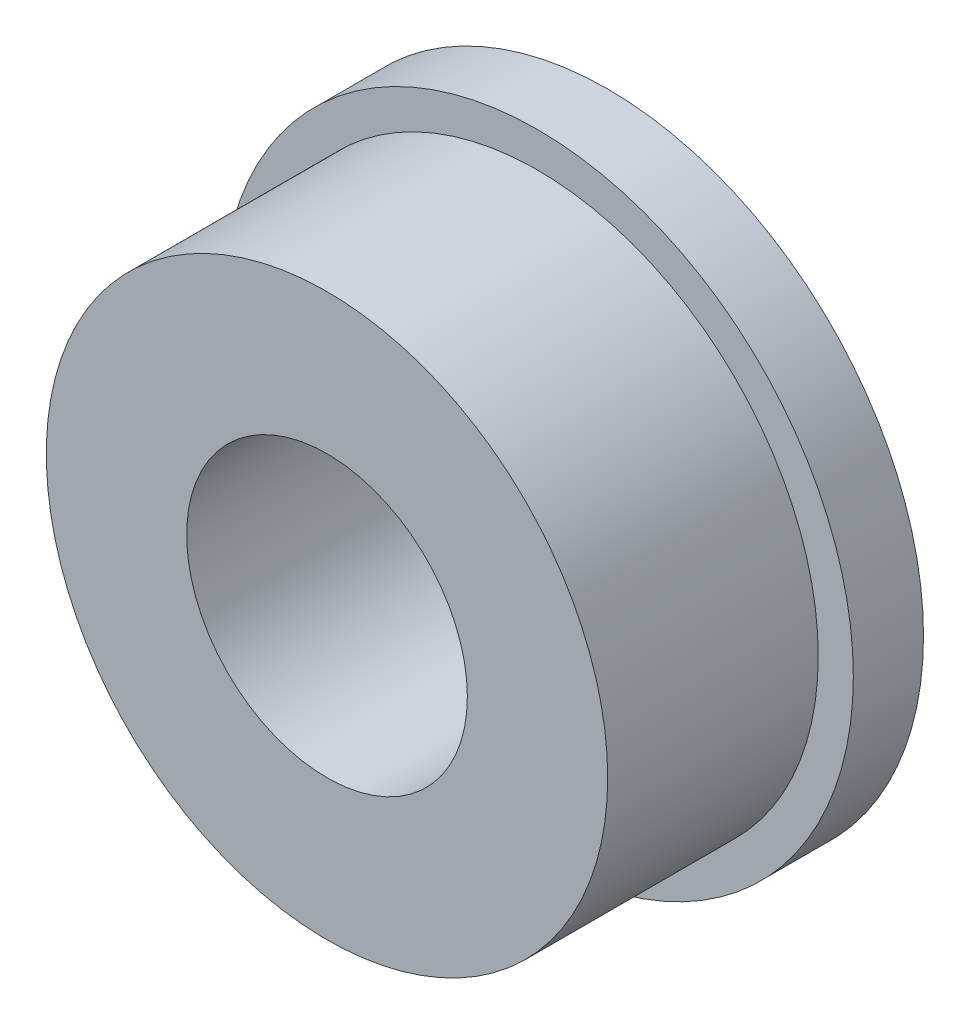
ISO-10303-21;
HEADER;
FILE_DESCRIPTION(('STEP AP214'),'2;1');
FILE_NAME('part.step','',(''),(''),'','','');
FILE_SCHEMA(('AUTOMOTIVE_DESIGN { 1 0 10303 214 1 1 1 1 }'));
ENDSEC;
DATA;
#1=APPLICATION_CONTEXT('core data for automotive mechanical design processes');
#2=APPLICATION_PROTOCOL_DEFINITION('international standard','automotive_design',2000,#1);
#3=PRODUCT_CONTEXT('',#1,'mechanical');
#4=PRODUCT('Part','Part','',(#3));
#5=PRODUCT_RELATED_PRODUCT_CATEGORY('part','',(#4));
#6=PRODUCT_DEFINITION_FORMATION('','',#4);
#7=PRODUCT_DEFINITION_CONTEXT('part definition',#1,'design');
#8=PRODUCT_DEFINITION('design','',#6,#7);
#9=PRODUCT_DEFINITION_SHAPE('','',#8);
#10=(LENGTH_UNIT() NAMED_UNIT(*) SI_UNIT(.MILLI.,.METRE.));
#11=(NAMED_UNIT(*) PLANE_ANGLE_UNIT() SI_UNIT($,.RADIAN.));
#12=(NAMED_UNIT(*) SI_UNIT($,.STERADIAN.) SOLID_ANGLE_UNIT());
#13=UNCERTAINTY_MEASURE_WITH_UNIT(LENGTH_MEASURE(1.E-05),#10,'distance_accuracy_value','');
#14=(GEOMETRIC_REPRESENTATION_CONTEXT(3) GLOBAL_UNCERTAINTY_ASSIGNED_CONTEXT((#13)) GLOBAL_UNIT_ASSIGNED_CONTEXT((#10,
#11,#12)) REPRESENTATION_CONTEXT('',''));
#15=CARTESIAN_POINT('',(0.,0.,0.));
#16=DIRECTION('',(0.,0.,1.));
#17=DIRECTION('',(1.,0.,0.));
#18=AXIS2_PLACEMENT_3D('',#15,#16,#17);
#19=CARTESIAN_POINT('',(0.,0.,2.));
#20=DIRECTION('',(0.,0.,1.));
#21=DIRECTION('',(1.,0.,0.));
#22=AXIS2_PLACEMENT_3D('',#19,#20,#21);
#23=PLANE('',#22);
#24=CARTESIAN_POINT('',(0.,0.,2.));
#25=DIRECTION('',(0.,0.,1.));
#26=DIRECTION('',(1.,0.,0.));
#27=AXIS2_PLACEMENT_3D('',#24,#25,#26);
#28=CIRCLE('',#27,8.);
#29=CARTESIAN_POINT('',(8.,0.,2.));
#30=VERTEX_POINT('',#29);
#31=EDGE_CURVE('E10',#30,#30,#28,.T.);
#32=ORIENTED_EDGE('',*,*,#31,.F.);
#33=EDGE_LOOP('',(#32));
#34=FACE_BOUND('',#33,.T.);
#35=CARTESIAN_POINT('',(0.,0.,2.));
#36=DIRECTION('',(0.,0.,1.));
#37=DIRECTION('',(1.,0.,0.));
#38=AXIS2_PLACEMENT_3D('',#35,#36,#37);
#39=CIRCLE('',#38,9.);
#40=CARTESIAN_POINT('',(9.,0.,2.));
#41=VERTEX_POINT('',#40);
#42=EDGE_CURVE('E38',#41,#41,#39,.T.);
#43=ORIENTED_EDGE('',*,*,#42,.T.);
#44=EDGE_LOOP('',(#43));
#45=FACE_BOUND('',#44,.T.);
#46=ADVANCED_FACE('F30',(#34,#45),#23,.T.);
#47=CARTESIAN_POINT('',(0.,0.,0.));
#48=DIRECTION('',(0.,0.,1.));
#49=DIRECTION('',(1.,0.,0.));
#50=AXIS2_PLACEMENT_3D('',#47,#48,#49);
#51=PLANE('',#50);
#52=CARTESIAN_POINT('',(0.,0.,0.));
#53=DIRECTION('',(0.,0.,1.));
#54=DIRECTION('',(1.,0.,0.));
#55=AXIS2_PLACEMENT_3D('',#52,#53,#54);
#56=CIRCLE('',#55,9.);
#57=CARTESIAN_POINT('',(9.,0.,0.));
#58=VERTEX_POINT('',#57);
#59=EDGE_CURVE('E34',#58,#58,#56,.T.);
#60=ORIENTED_EDGE('',*,*,#59,.F.);
#61=EDGE_LOOP('',(#60));
#62=FACE_BOUND('',#61,.T.);
#63=CARTESIAN_POINT('',(0.,0.,0.));
#64=DIRECTION('',(0.,0.,1.));
#65=DIRECTION('',(1.,0.,0.));
#66=AXIS2_PLACEMENT_3D('',#63,#64,#65);
#67=CIRCLE('',#66,4.);
#68=CARTESIAN_POINT('',(4.,0.,0.));
#69=VERTEX_POINT('',#68);
#70=EDGE_CURVE('E47',#69,#69,#67,.T.);
#71=ORIENTED_EDGE('',*,*,#70,.T.);
#72=EDGE_LOOP('',(#71));
#73=FACE_BOUND('',#72,.T.);
#74=ADVANCED_FACE('F74',(#62,#73),#51,.F.);
#75=CARTESIAN_POINT('',(0.,0.,2.));
#76=DIRECTION('',(0.,0.,-1.));
#77=DIRECTION('',(-1.,0.,0.));
#78=AXIS2_PLACEMENT_3D('',#75,#76,#77);
#79=CYLINDRICAL_SURFACE('',#78,9.);
#80=ORIENTED_EDGE('',*,*,#42,.F.);
#81=EDGE_LOOP('',(#80));
#82=FACE_BOUND('',#81,.T.);
#83=ORIENTED_EDGE('',*,*,#59,.T.);
#84=EDGE_LOOP('',(#83));
#85=FACE_BOUND('',#84,.T.);
#86=ADVANCED_FACE('F32',(#82,#85),#79,.T.);
#87=CARTESIAN_POINT('',(0.,0.,2.));
#88=DIRECTION('',(0.,0.,-1.));
#89=DIRECTION('',(-1.,0.,0.));
#90=AXIS2_PLACEMENT_3D('',#87,#88,#89);
#91=CYLINDRICAL_SURFACE('',#90,4.);
#92=ORIENTED_EDGE('',*,*,#70,.F.);
#93=EDGE_LOOP('',(#92));
#94=FACE_BOUND('',#93,.T.);
#95=CARTESIAN_POINT('',(0.,0.,8.));
#96=DIRECTION('',(0.,0.,1.));
#97=DIRECTION('',(1.,0.,0.));
#98=AXIS2_PLACEMENT_3D('',#95,#96,#97);
#99=CIRCLE('',#98,4.);
#100=CARTESIAN_POINT('',(4.,0.,8.));
#101=VERTEX_POINT('',#100);
#102=EDGE_CURVE('E53',#101,#101,#99,.T.);
#103=ORIENTED_EDGE('',*,*,#102,.T.);
#104=EDGE_LOOP('',(#103));
#105=FACE_BOUND('',#104,.T.);
#106=ADVANCED_FACE('F59',(#94,#105),#91,.F.);
#107=CARTESIAN_POINT('',(0.,0.,8.));
#108=DIRECTION('',(0.,0.,1.));
#109=DIRECTION('',(1.,0.,0.));
#110=AXIS2_PLACEMENT_3D('',#107,#108,#109);
#111=PLANE('',#110);
#112=CARTESIAN_POINT('',(0.,0.,8.));
#113=DIRECTION('',(0.,0.,1.));
#114=DIRECTION('',(1.,0.,0.));
#115=AXIS2_PLACEMENT_3D('',#112,#113,#114);
#116=CIRCLE('',#115,8.);
#117=CARTESIAN_POINT('',(8.,0.,8.));
#118=VERTEX_POINT('',#117);
#119=EDGE_CURVE('E45',#118,#118,#116,.T.);
#120=ORIENTED_EDGE('',*,*,#119,.T.);
#121=EDGE_LOOP('',(#120));
#122=FACE_BOUND('',#121,.T.);
#123=ORIENTED_EDGE('',*,*,#102,.F.);
#124=EDGE_LOOP('',(#123));
#125=FACE_BOUND('',#124,.T.);
#126=ADVANCED_FACE('F61',(#122,#125),#111,.T.);
#127=CARTESIAN_POINT('',(0.,0.,8.));
#128=DIRECTION('',(0.,0.,-1.));
#129=DIRECTION('',(-1.,0.,0.));
#130=AXIS2_PLACEMENT_3D('',#127,#128,#129);
#131=CYLINDRICAL_SURFACE('',#130,8.);
#132=ORIENTED_EDGE('',*,*,#119,.F.);
#133=EDGE_LOOP('',(#132));
#134=FACE_BOUND('',#133,.T.);
#135=ORIENTED_EDGE('',*,*,#31,.T.);
#136=EDGE_LOOP('',(#135));
#137=FACE_BOUND('',#136,.T.);
#138=ADVANCED_FACE('F63',(#134,#137),#131,.T.);
#139=CLOSED_SHELL('',(#46,#74,#86,#106,#126,#138));
#140=MANIFOLD_SOLID_BREP('B2',#139);
#141=ADVANCED_BREP_SHAPE_REPRESENTATION('',(#18,#140),#14);
#142=SHAPE_DEFINITION_REPRESENTATION(#9,#141);
ENDSEC;
END-ISO-10303-21;
